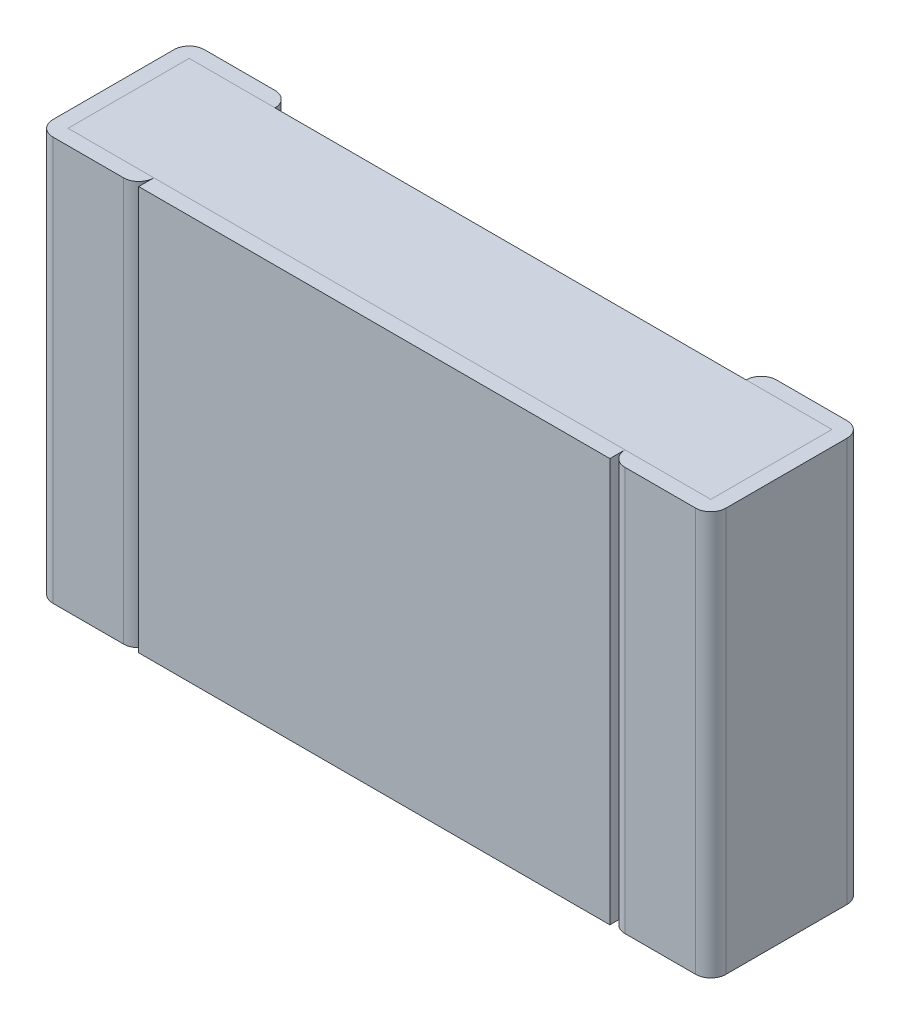
ISO-10303-21;
HEADER;
FILE_DESCRIPTION(('STEP AP214'),'2;1');
FILE_NAME('part.step','',(''),(''),'','','');
FILE_SCHEMA(('AUTOMOTIVE_DESIGN { 1 0 10303 214 1 1 1 1 }'));
ENDSEC;
DATA;
#1=APPLICATION_CONTEXT('core data for automotive mechanical design processes');
#2=APPLICATION_PROTOCOL_DEFINITION('international standard','automotive_design',2000,#1);
#3=PRODUCT_CONTEXT('',#1,'mechanical');
#4=PRODUCT('Part','Part','',(#3));
#5=PRODUCT_RELATED_PRODUCT_CATEGORY('part','',(#4));
#6=PRODUCT_DEFINITION_FORMATION('','',#4);
#7=PRODUCT_DEFINITION_CONTEXT('part definition',#1,'design');
#8=PRODUCT_DEFINITION('design','',#6,#7);
#9=PRODUCT_DEFINITION_SHAPE('','',#8);
#10=(LENGTH_UNIT() NAMED_UNIT(*) SI_UNIT(.MILLI.,.METRE.));
#11=(NAMED_UNIT(*) PLANE_ANGLE_UNIT() SI_UNIT($,.RADIAN.));
#12=(NAMED_UNIT(*) SI_UNIT($,.STERADIAN.) SOLID_ANGLE_UNIT());
#13=UNCERTAINTY_MEASURE_WITH_UNIT(LENGTH_MEASURE(1.E-05),#10,'distance_accuracy_value','');
#14=(GEOMETRIC_REPRESENTATION_CONTEXT(3) GLOBAL_UNCERTAINTY_ASSIGNED_CONTEXT((#13)) GLOBAL_UNIT_ASSIGNED_CONTEXT((#10,
#11,#12)) REPRESENTATION_CONTEXT('',''));
#15=CARTESIAN_POINT('',(0.,0.,0.));
#16=DIRECTION('',(0.,0.,1.));
#17=DIRECTION('',(1.,0.,0.));
#18=AXIS2_PLACEMENT_3D('',#15,#16,#17);
#19=CARTESIAN_POINT('',(-1.,-0.6,0.));
#20=DIRECTION('',(1.,0.,0.));
#21=DIRECTION('',(0.,1.,0.));
#22=AXIS2_PLACEMENT_3D('',#19,#20,#21);
#23=PLANE('',#22);
#24=DIRECTION('',(0.,1.,0.));
#25=VECTOR('',#24,1.);
#26=CARTESIAN_POINT('',(-1.,-0.6,0.405));
#27=LINE('',#26,#25);
#28=CARTESIAN_POINT('',(-1.,-0.6,0.405));
#29=VERTEX_POINT('',#28);
#30=CARTESIAN_POINT('',(-1.,0.6,0.405));
#31=VERTEX_POINT('',#30);
#32=EDGE_CURVE('E11',#29,#31,#27,.T.);
#33=ORIENTED_EDGE('',*,*,#32,.T.);
#34=DIRECTION('',(0.,0.,1.));
#35=VECTOR('',#34,1.);
#36=CARTESIAN_POINT('',(-1.,0.6,0.));
#37=LINE('',#36,#35);
#38=CARTESIAN_POINT('',(-1.,0.6,0.045));
#39=VERTEX_POINT('',#38);
#40=EDGE_CURVE('E40',#39,#31,#37,.T.);
#41=ORIENTED_EDGE('',*,*,#40,.F.);
#42=DIRECTION('',(0.,1.,0.));
#43=VECTOR('',#42,1.);
#44=CARTESIAN_POINT('',(-1.,-0.6,0.045));
#45=LINE('',#44,#43);
#46=CARTESIAN_POINT('',(-1.,-0.6,0.045));
#47=VERTEX_POINT('',#46);
#48=EDGE_CURVE('E309',#47,#39,#45,.T.);
#49=ORIENTED_EDGE('',*,*,#48,.F.);
#50=DIRECTION('',(0.,0.,1.));
#51=VECTOR('',#50,1.);
#52=CARTESIAN_POINT('',(-1.,-0.6,0.));
#53=LINE('',#52,#51);
#54=EDGE_CURVE('E26',#47,#29,#53,.T.);
#55=ORIENTED_EDGE('',*,*,#54,.T.);
#56=EDGE_LOOP('',(#33,#41,#49,#55));
#57=FACE_BOUND('',#56,.T.);
#58=ADVANCED_FACE('F16',(#57),#23,.F.);
#59=CARTESIAN_POINT('',(-1.,-0.6,0.));
#60=DIRECTION('',(0.,1.,0.));
#61=DIRECTION('',(1.,0.,0.));
#62=AXIS2_PLACEMENT_3D('',#59,#60,#61);
#63=PLANE('',#62);
#64=CARTESIAN_POINT('',(-0.745,-0.6,0.045));
#65=DIRECTION('',(0.,1.,0.));
#66=DIRECTION('',(0.,0.,1.));
#67=AXIS2_PLACEMENT_3D('',#64,#65,#66);
#68=CIRCLE('',#67,0.045);
#69=CARTESIAN_POINT('',(-0.7,-0.6,0.045));
#70=VERTEX_POINT('',#69);
#71=CARTESIAN_POINT('',(-0.745,-0.6,0.));
#72=VERTEX_POINT('',#71);
#73=EDGE_CURVE('E215',#70,#72,#68,.T.);
#74=ORIENTED_EDGE('',*,*,#73,.F.);
#75=DIRECTION('',(1.,0.,0.));
#76=VECTOR('',#75,1.);
#77=CARTESIAN_POINT('',(-0.955,-0.6,0.045));
#78=LINE('',#77,#76);
#79=CARTESIAN_POINT('',(-0.955,-0.6,0.045));
#80=VERTEX_POINT('',#79);
#81=EDGE_CURVE('E230',#80,#70,#78,.T.);
#82=ORIENTED_EDGE('',*,*,#81,.F.);
#83=DIRECTION('',(0.,0.,1.));
#84=VECTOR('',#83,1.);
#85=CARTESIAN_POINT('',(-0.955,-0.6,0.045));
#86=LINE('',#85,#84);
#87=CARTESIAN_POINT('',(-0.955,-0.6,0.405));
#88=VERTEX_POINT('',#87);
#89=EDGE_CURVE('E235',#80,#88,#86,.T.);
#90=ORIENTED_EDGE('',*,*,#89,.T.);
#91=DIRECTION('',(1.,0.,0.));
#92=VECTOR('',#91,1.);
#93=CARTESIAN_POINT('',(-0.955,-0.6,0.405));
#94=LINE('',#93,#92);
#95=CARTESIAN_POINT('',(-0.7,-0.6,0.405));
#96=VERTEX_POINT('',#95);
#97=EDGE_CURVE('E323',#88,#96,#94,.T.);
#98=ORIENTED_EDGE('',*,*,#97,.T.);
#99=CARTESIAN_POINT('',(-0.745,-0.6,0.405));
#100=DIRECTION('',(0.,-1.,0.));
#101=DIRECTION('',(0.,0.,1.));
#102=AXIS2_PLACEMENT_3D('',#99,#100,#101);
#103=CIRCLE('',#102,0.045);
#104=CARTESIAN_POINT('',(-0.745,-0.6,0.45));
#105=VERTEX_POINT('',#104);
#106=EDGE_CURVE('E327',#96,#105,#103,.T.);
#107=ORIENTED_EDGE('',*,*,#106,.T.);
#108=DIRECTION('',(1.,0.,0.));
#109=VECTOR('',#108,1.);
#110=CARTESIAN_POINT('',(-1.,-0.6,0.45));
#111=LINE('',#110,#109);
#112=CARTESIAN_POINT('',(-0.955,-0.6,0.45));
#113=VERTEX_POINT('',#112);
#114=EDGE_CURVE('E239',#113,#105,#111,.T.);
#115=ORIENTED_EDGE('',*,*,#114,.F.);
#116=CARTESIAN_POINT('',(-0.955,-0.6,0.405));
#117=DIRECTION('',(0.,1.,0.));
#118=DIRECTION('',(0.,0.,1.));
#119=AXIS2_PLACEMENT_3D('',#116,#117,#118);
#120=CIRCLE('',#119,0.045);
#121=EDGE_CURVE('E273',#29,#113,#120,.T.);
#122=ORIENTED_EDGE('',*,*,#121,.F.);
#123=ORIENTED_EDGE('',*,*,#54,.F.);
#124=CARTESIAN_POINT('',(-0.955,-0.6,0.045));
#125=DIRECTION('',(0.,-1.,0.));
#126=DIRECTION('',(0.,0.,1.));
#127=AXIS2_PLACEMENT_3D('',#124,#125,#126);
#128=CIRCLE('',#127,0.045);
#129=CARTESIAN_POINT('',(-0.955,-0.6,0.));
#130=VERTEX_POINT('',#129);
#131=EDGE_CURVE('E308',#47,#130,#128,.T.);
#132=ORIENTED_EDGE('',*,*,#131,.T.);
#133=DIRECTION('',(1.,0.,0.));
#134=VECTOR('',#133,1.);
#135=CARTESIAN_POINT('',(-1.,-0.6,0.));
#136=LINE('',#135,#134);
#137=EDGE_CURVE('E243',#130,#72,#136,.T.);
#138=ORIENTED_EDGE('',*,*,#137,.T.);
#139=EDGE_LOOP('',(#74,#82,#90,#98,#107,#115,#122,#123,#132,#138));
#140=FACE_BOUND('',#139,.T.);
#141=ADVANCED_FACE('F241',(#140),#63,.F.);
#142=CARTESIAN_POINT('',(-0.955,-0.6,0.045));
#143=DIRECTION('',(0.,1.,0.));
#144=DIRECTION('',(-1.,0.,0.));
#145=AXIS2_PLACEMENT_3D('',#142,#143,#144);
#146=CYLINDRICAL_SURFACE('',#145,0.045);
#147=ORIENTED_EDGE('',*,*,#48,.T.);
#148=CARTESIAN_POINT('',(-0.955,0.6,0.045));
#149=DIRECTION('',(0.,-1.,0.));
#150=DIRECTION('',(0.,0.,1.));
#151=AXIS2_PLACEMENT_3D('',#148,#149,#150);
#152=CIRCLE('',#151,0.045);
#153=CARTESIAN_POINT('',(-0.955,0.6,0.));
#154=VERTEX_POINT('',#153);
#155=EDGE_CURVE('E277',#39,#154,#152,.T.);
#156=ORIENTED_EDGE('',*,*,#155,.T.);
#157=DIRECTION('',(0.,1.,0.));
#158=VECTOR('',#157,1.);
#159=CARTESIAN_POINT('',(-0.955,-0.6,0.));
#160=LINE('',#159,#158);
#161=EDGE_CURVE('E305',#130,#154,#160,.T.);
#162=ORIENTED_EDGE('',*,*,#161,.F.);
#163=ORIENTED_EDGE('',*,*,#131,.F.);
#164=EDGE_LOOP('',(#147,#156,#162,#163));
#165=FACE_BOUND('',#164,.T.);
#166=ADVANCED_FACE('F562',(#165),#146,.T.);
#167=CARTESIAN_POINT('',(-0.955,-0.6,0.405));
#168=DIRECTION('',(0.,1.,0.));
#169=DIRECTION('',(-1.,0.,0.));
#170=AXIS2_PLACEMENT_3D('',#167,#168,#169);
#171=CYLINDRICAL_SURFACE('',#170,0.045);
#172=ORIENTED_EDGE('',*,*,#121,.T.);
#173=DIRECTION('',(0.,1.,0.));
#174=VECTOR('',#173,1.);
#175=CARTESIAN_POINT('',(-0.955,-0.6,0.45));
#176=LINE('',#175,#174);
#177=CARTESIAN_POINT('',(-0.955,0.6,0.45));
#178=VERTEX_POINT('',#177);
#179=EDGE_CURVE('E278',#113,#178,#176,.T.);
#180=ORIENTED_EDGE('',*,*,#179,.T.);
#181=CARTESIAN_POINT('',(-0.955,0.6,0.405));
#182=DIRECTION('',(0.,1.,0.));
#183=DIRECTION('',(0.,0.,1.));
#184=AXIS2_PLACEMENT_3D('',#181,#182,#183);
#185=CIRCLE('',#184,0.045);
#186=EDGE_CURVE('E287',#31,#178,#185,.T.);
#187=ORIENTED_EDGE('',*,*,#186,.F.);
#188=ORIENTED_EDGE('',*,*,#32,.F.);
#189=EDGE_LOOP('',(#172,#180,#187,#188));
#190=FACE_BOUND('',#189,.T.);
#191=ADVANCED_FACE('F568',(#190),#171,.T.);
#192=CARTESIAN_POINT('',(-1.,0.6,0.));
#193=DIRECTION('',(0.,1.,0.));
#194=DIRECTION('',(1.,0.,0.));
#195=AXIS2_PLACEMENT_3D('',#192,#193,#194);
#196=PLANE('',#195);
#197=DIRECTION('',(1.,0.,0.));
#198=VECTOR('',#197,1.);
#199=CARTESIAN_POINT('',(-1.,0.6,0.));
#200=LINE('',#199,#198);
#201=CARTESIAN_POINT('',(-0.745,0.6,0.));
#202=VERTEX_POINT('',#201);
#203=EDGE_CURVE('E246',#154,#202,#200,.T.);
#204=ORIENTED_EDGE('',*,*,#203,.F.);
#205=ORIENTED_EDGE('',*,*,#155,.F.);
#206=ORIENTED_EDGE('',*,*,#40,.T.);
#207=ORIENTED_EDGE('',*,*,#186,.T.);
#208=DIRECTION('',(1.,0.,0.));
#209=VECTOR('',#208,1.);
#210=CARTESIAN_POINT('',(-1.,0.6,0.45));
#211=LINE('',#210,#209);
#212=CARTESIAN_POINT('',(-0.745,0.6,0.45));
#213=VERTEX_POINT('',#212);
#214=EDGE_CURVE('E290',#178,#213,#211,.T.);
#215=ORIENTED_EDGE('',*,*,#214,.T.);
#216=CARTESIAN_POINT('',(-0.745,0.6,0.405));
#217=DIRECTION('',(0.,-1.,0.));
#218=DIRECTION('',(0.,0.,1.));
#219=AXIS2_PLACEMENT_3D('',#216,#217,#218);
#220=CIRCLE('',#219,0.045);
#221=CARTESIAN_POINT('',(-0.7,0.6,0.405));
#222=VERTEX_POINT('',#221);
#223=EDGE_CURVE('E369',#222,#213,#220,.T.);
#224=ORIENTED_EDGE('',*,*,#223,.F.);
#225=DIRECTION('',(1.,0.,0.));
#226=VECTOR('',#225,1.);
#227=CARTESIAN_POINT('',(-0.955,0.6,0.405));
#228=LINE('',#227,#226);
#229=CARTESIAN_POINT('',(-0.955,0.6,0.405));
#230=VERTEX_POINT('',#229);
#231=EDGE_CURVE('E378',#230,#222,#228,.T.);
#232=ORIENTED_EDGE('',*,*,#231,.F.);
#233=DIRECTION('',(0.,0.,1.));
#234=VECTOR('',#233,1.);
#235=CARTESIAN_POINT('',(-0.955,0.6,0.045));
#236=LINE('',#235,#234);
#237=CARTESIAN_POINT('',(-0.955,0.6,0.045));
#238=VERTEX_POINT('',#237);
#239=EDGE_CURVE('E373',#238,#230,#236,.T.);
#240=ORIENTED_EDGE('',*,*,#239,.F.);
#241=DIRECTION('',(1.,0.,0.));
#242=VECTOR('',#241,1.);
#243=CARTESIAN_POINT('',(-0.955,0.6,0.045));
#244=LINE('',#243,#242);
#245=CARTESIAN_POINT('',(-0.7,0.6,0.045));
#246=VERTEX_POINT('',#245);
#247=EDGE_CURVE('E298',#238,#246,#244,.T.);
#248=ORIENTED_EDGE('',*,*,#247,.T.);
#249=CARTESIAN_POINT('',(-0.745,0.6,0.045));
#250=DIRECTION('',(0.,1.,0.));
#251=DIRECTION('',(0.,0.,1.));
#252=AXIS2_PLACEMENT_3D('',#249,#250,#251);
#253=CIRCLE('',#252,0.045);
#254=EDGE_CURVE('E218',#246,#202,#253,.T.);
#255=ORIENTED_EDGE('',*,*,#254,.T.);
#256=EDGE_LOOP('',(#204,#205,#206,#207,#215,#224,#232,#240,#248,#255));
#257=FACE_BOUND('',#256,.T.);
#258=ADVANCED_FACE('F533',(#257),#196,.T.);
#259=CARTESIAN_POINT('',(-1.,-0.6,0.));
#260=DIRECTION('',(0.,0.,1.));
#261=DIRECTION('',(1.,0.,0.));
#262=AXIS2_PLACEMENT_3D('',#259,#260,#261);
#263=PLANE('',#262);
#264=DIRECTION('',(0.,1.,0.));
#265=VECTOR('',#264,1.);
#266=CARTESIAN_POINT('',(-0.745,-0.6,0.));
#267=LINE('',#266,#265);
#268=EDGE_CURVE('E247',#72,#202,#267,.T.);
#269=ORIENTED_EDGE('',*,*,#268,.F.);
#270=ORIENTED_EDGE('',*,*,#137,.F.);
#271=ORIENTED_EDGE('',*,*,#161,.T.);
#272=ORIENTED_EDGE('',*,*,#203,.T.);
#273=EDGE_LOOP('',(#269,#270,#271,#272));
#274=FACE_BOUND('',#273,.T.);
#275=ADVANCED_FACE('F559',(#274),#263,.F.);
#276=CARTESIAN_POINT('',(-0.745,-0.6,0.045));
#277=DIRECTION('',(0.,1.,0.));
#278=DIRECTION('',(1.,0.,0.));
#279=AXIS2_PLACEMENT_3D('',#276,#277,#278);
#280=CYLINDRICAL_SURFACE('',#279,0.045);
#281=ORIENTED_EDGE('',*,*,#73,.T.);
#282=ORIENTED_EDGE('',*,*,#268,.T.);
#283=ORIENTED_EDGE('',*,*,#254,.F.);
#284=DIRECTION('',(0.,1.,0.));
#285=VECTOR('',#284,1.);
#286=CARTESIAN_POINT('',(-0.7,-0.6,0.045));
#287=LINE('',#286,#285);
#288=EDGE_CURVE('E210',#70,#246,#287,.T.);
#289=ORIENTED_EDGE('',*,*,#288,.F.);
#290=EDGE_LOOP('',(#281,#282,#283,#289));
#291=FACE_BOUND('',#290,.T.);
#292=ADVANCED_FACE('F212',(#291),#280,.T.);
#293=CARTESIAN_POINT('',(-0.955,-0.6,0.045));
#294=DIRECTION('',(0.,1.,0.));
#295=DIRECTION('',(1.,0.,0.));
#296=AXIS2_PLACEMENT_3D('',#293,#294,#295);
#297=PLANE('',#296);
#298=DIRECTION('',(1.,0.,0.));
#299=VECTOR('',#298,1.);
#300=CARTESIAN_POINT('',(-0.955,-0.6,0.045));
#301=LINE('',#300,#299);
#302=CARTESIAN_POINT('',(0.7,-0.6,0.045));
#303=VERTEX_POINT('',#302);
#304=EDGE_CURVE('E232',#70,#303,#301,.T.);
#305=ORIENTED_EDGE('',*,*,#304,.T.);
#306=DIRECTION('',(1.,0.,0.));
#307=VECTOR('',#306,1.);
#308=CARTESIAN_POINT('',(-0.955,-0.6,0.045));
#309=LINE('',#308,#307);
#310=CARTESIAN_POINT('',(0.955,-0.6,0.045));
#311=VERTEX_POINT('',#310);
#312=EDGE_CURVE('E253',#303,#311,#309,.T.);
#313=ORIENTED_EDGE('',*,*,#312,.T.);
#314=DIRECTION('',(0.,0.,1.));
#315=VECTOR('',#314,1.);
#316=CARTESIAN_POINT('',(0.955,-0.6,0.045));
#317=LINE('',#316,#315);
#318=CARTESIAN_POINT('',(0.955,-0.6,0.405));
#319=VERTEX_POINT('',#318);
#320=EDGE_CURVE('E238',#311,#319,#317,.T.);
#321=ORIENTED_EDGE('',*,*,#320,.T.);
#322=DIRECTION('',(1.,0.,0.));
#323=VECTOR('',#322,1.);
#324=CARTESIAN_POINT('',(-0.955,-0.6,0.405));
#325=LINE('',#324,#323);
#326=CARTESIAN_POINT('',(0.7,-0.6,0.405));
#327=VERTEX_POINT('',#326);
#328=EDGE_CURVE('E359',#327,#319,#325,.T.);
#329=ORIENTED_EDGE('',*,*,#328,.F.);
#330=DIRECTION('',(1.,0.,0.));
#331=VECTOR('',#330,1.);
#332=CARTESIAN_POINT('',(-0.7,-0.6,0.405));
#333=LINE('',#332,#331);
#334=EDGE_CURVE('E272',#96,#327,#333,.T.);
#335=ORIENTED_EDGE('',*,*,#334,.F.);
#336=ORIENTED_EDGE('',*,*,#97,.F.);
#337=ORIENTED_EDGE('',*,*,#89,.F.);
#338=ORIENTED_EDGE('',*,*,#81,.T.);
#339=EDGE_LOOP('',(#305,#313,#321,#329,#335,#336,#337,#338));
#340=FACE_BOUND('',#339,.T.);
#341=ADVANCED_FACE('F231',(#340),#297,.F.);
#342=CARTESIAN_POINT('',(-1.,-0.6,0.45));
#343=DIRECTION('',(0.,0.,1.));
#344=DIRECTION('',(1.,0.,0.));
#345=AXIS2_PLACEMENT_3D('',#342,#343,#344);
#346=PLANE('',#345);
#347=ORIENTED_EDGE('',*,*,#214,.F.);
#348=ORIENTED_EDGE('',*,*,#179,.F.);
#349=ORIENTED_EDGE('',*,*,#114,.T.);
#350=DIRECTION('',(0.,1.,0.));
#351=VECTOR('',#350,1.);
#352=CARTESIAN_POINT('',(-0.745,-0.6,0.45));
#353=LINE('',#352,#351);
#354=EDGE_CURVE('E19',#105,#213,#353,.T.);
#355=ORIENTED_EDGE('',*,*,#354,.T.);
#356=EDGE_LOOP('',(#347,#348,#349,#355));
#357=FACE_BOUND('',#356,.T.);
#358=ADVANCED_FACE('F547',(#357),#346,.T.);
#359=CARTESIAN_POINT('',(-0.745,-0.6,0.405));
#360=DIRECTION('',(0.,1.,0.));
#361=DIRECTION('',(1.,0.,0.));
#362=AXIS2_PLACEMENT_3D('',#359,#360,#361);
#363=CYLINDRICAL_SURFACE('',#362,0.045);
#364=DIRECTION('',(0.,1.,0.));
#365=VECTOR('',#364,1.);
#366=CARTESIAN_POINT('',(-0.7,-0.6,0.405));
#367=LINE('',#366,#365);
#368=EDGE_CURVE('E372',#96,#222,#367,.T.);
#369=ORIENTED_EDGE('',*,*,#368,.T.);
#370=ORIENTED_EDGE('',*,*,#223,.T.);
#371=ORIENTED_EDGE('',*,*,#354,.F.);
#372=ORIENTED_EDGE('',*,*,#106,.F.);
#373=EDGE_LOOP('',(#369,#370,#371,#372));
#374=FACE_BOUND('',#373,.T.);
#375=ADVANCED_FACE('F541',(#374),#363,.T.);
#376=CARTESIAN_POINT('',(-0.955,0.6,0.045));
#377=DIRECTION('',(0.,1.,0.));
#378=DIRECTION('',(1.,0.,0.));
#379=AXIS2_PLACEMENT_3D('',#376,#377,#378);
#380=PLANE('',#379);
#381=ORIENTED_EDGE('',*,*,#247,.F.);
#382=ORIENTED_EDGE('',*,*,#239,.T.);
#383=ORIENTED_EDGE('',*,*,#231,.T.);
#384=DIRECTION('',(1.,0.,0.));
#385=VECTOR('',#384,1.);
#386=CARTESIAN_POINT('',(-0.7,0.6,0.405));
#387=LINE('',#386,#385);
#388=CARTESIAN_POINT('',(0.7,0.6,0.405));
#389=VERTEX_POINT('',#388);
#390=EDGE_CURVE('E374',#222,#389,#387,.T.);
#391=ORIENTED_EDGE('',*,*,#390,.T.);
#392=DIRECTION('',(1.,0.,0.));
#393=VECTOR('',#392,1.);
#394=CARTESIAN_POINT('',(-0.955,0.6,0.405));
#395=LINE('',#394,#393);
#396=CARTESIAN_POINT('',(0.955,0.6,0.405));
#397=VERTEX_POINT('',#396);
#398=EDGE_CURVE('E379',#389,#397,#395,.T.);
#399=ORIENTED_EDGE('',*,*,#398,.T.);
#400=DIRECTION('',(0.,0.,1.));
#401=VECTOR('',#400,1.);
#402=CARTESIAN_POINT('',(0.955,0.6,0.045));
#403=LINE('',#402,#401);
#404=CARTESIAN_POINT('',(0.955,0.6,0.045));
#405=VERTEX_POINT('',#404);
#406=EDGE_CURVE('E331',#405,#397,#403,.T.);
#407=ORIENTED_EDGE('',*,*,#406,.F.);
#408=DIRECTION('',(1.,0.,0.));
#409=VECTOR('',#408,1.);
#410=CARTESIAN_POINT('',(-0.955,0.6,0.045));
#411=LINE('',#410,#409);
#412=CARTESIAN_POINT('',(0.7,0.6,0.045));
#413=VERTEX_POINT('',#412);
#414=EDGE_CURVE('E317',#413,#405,#411,.T.);
#415=ORIENTED_EDGE('',*,*,#414,.F.);
#416=DIRECTION('',(1.,0.,0.));
#417=VECTOR('',#416,1.);
#418=CARTESIAN_POINT('',(-0.955,0.6,0.045));
#419=LINE('',#418,#417);
#420=EDGE_CURVE('E224',#246,#413,#419,.T.);
#421=ORIENTED_EDGE('',*,*,#420,.F.);
#422=EDGE_LOOP('',(#381,#382,#383,#391,#399,#407,#415,#421));
#423=FACE_BOUND('',#422,.T.);
#424=ADVANCED_FACE('F531',(#423),#380,.T.);
#425=CARTESIAN_POINT('',(-0.955,-0.6,0.045));
#426=DIRECTION('',(0.,0.,1.));
#427=DIRECTION('',(1.,0.,0.));
#428=AXIS2_PLACEMENT_3D('',#425,#426,#427);
#429=PLANE('',#428);
#430=ORIENTED_EDGE('',*,*,#420,.T.);
#431=DIRECTION('',(0.,1.,0.));
#432=VECTOR('',#431,1.);
#433=CARTESIAN_POINT('',(0.7,-0.6,0.045));
#434=LINE('',#433,#432);
#435=EDGE_CURVE('E250',#303,#413,#434,.T.);
#436=ORIENTED_EDGE('',*,*,#435,.F.);
#437=ORIENTED_EDGE('',*,*,#304,.F.);
#438=ORIENTED_EDGE('',*,*,#288,.T.);
#439=EDGE_LOOP('',(#430,#436,#437,#438));
#440=FACE_BOUND('',#439,.T.);
#441=ADVANCED_FACE('F249',(#440),#429,.F.);
#442=CARTESIAN_POINT('',(0.7,-0.6,0.));
#443=DIRECTION('',(0.,1.,0.));
#444=DIRECTION('',(1.,0.,0.));
#445=AXIS2_PLACEMENT_3D('',#442,#443,#444);
#446=PLANE('',#445);
#447=CARTESIAN_POINT('',(0.955,-0.6,0.045));
#448=DIRECTION('',(0.,1.,0.));
#449=DIRECTION('',(0.,0.,1.));
#450=AXIS2_PLACEMENT_3D('',#447,#448,#449);
#451=CIRCLE('',#450,0.045);
#452=CARTESIAN_POINT('',(1.,-0.6,0.045));
#453=VERTEX_POINT('',#452);
#454=CARTESIAN_POINT('',(0.955,-0.6,0.));
#455=VERTEX_POINT('',#454);
#456=EDGE_CURVE('E111',#453,#455,#451,.T.);
#457=ORIENTED_EDGE('',*,*,#456,.F.);
#458=DIRECTION('',(0.,0.,1.));
#459=VECTOR('',#458,1.);
#460=CARTESIAN_POINT('',(1.,-0.6,0.));
#461=LINE('',#460,#459);
#462=CARTESIAN_POINT('',(1.,-0.6,0.405));
#463=VERTEX_POINT('',#462);
#464=EDGE_CURVE('E225',#453,#463,#461,.T.);
#465=ORIENTED_EDGE('',*,*,#464,.T.);
#466=CARTESIAN_POINT('',(0.955,-0.6,0.405));
#467=DIRECTION('',(0.,-1.,0.));
#468=DIRECTION('',(0.,0.,1.));
#469=AXIS2_PLACEMENT_3D('',#466,#467,#468);
#470=CIRCLE('',#469,0.045);
#471=CARTESIAN_POINT('',(0.955,-0.6,0.45));
#472=VERTEX_POINT('',#471);
#473=EDGE_CURVE('E335',#463,#472,#470,.T.);
#474=ORIENTED_EDGE('',*,*,#473,.T.);
#475=DIRECTION('',(1.,0.,0.));
#476=VECTOR('',#475,1.);
#477=CARTESIAN_POINT('',(0.7,-0.6,0.45));
#478=LINE('',#477,#476);
#479=CARTESIAN_POINT('',(0.745,-0.6,0.45));
#480=VERTEX_POINT('',#479);
#481=EDGE_CURVE('E363',#480,#472,#478,.T.);
#482=ORIENTED_EDGE('',*,*,#481,.F.);
#483=CARTESIAN_POINT('',(0.745,-0.6,0.405));
#484=DIRECTION('',(0.,1.,0.));
#485=DIRECTION('',(0.,0.,1.));
#486=AXIS2_PLACEMENT_3D('',#483,#484,#485);
#487=CIRCLE('',#486,0.045);
#488=EDGE_CURVE('E406',#327,#480,#487,.T.);
#489=ORIENTED_EDGE('',*,*,#488,.F.);
#490=ORIENTED_EDGE('',*,*,#328,.T.);
#491=ORIENTED_EDGE('',*,*,#320,.F.);
#492=ORIENTED_EDGE('',*,*,#312,.F.);
#493=CARTESIAN_POINT('',(0.745,-0.6,0.045));
#494=DIRECTION('',(0.,-1.,0.));
#495=DIRECTION('',(0.,0.,1.));
#496=AXIS2_PLACEMENT_3D('',#493,#494,#495);
#497=CIRCLE('',#496,0.045);
#498=CARTESIAN_POINT('',(0.745,-0.6,0.));
#499=VERTEX_POINT('',#498);
#500=EDGE_CURVE('E267',#303,#499,#497,.T.);
#501=ORIENTED_EDGE('',*,*,#500,.T.);
#502=DIRECTION('',(1.,0.,0.));
#503=VECTOR('',#502,1.);
#504=CARTESIAN_POINT('',(0.7,-0.6,0.));
#505=LINE('',#504,#503);
#506=EDGE_CURVE('E95',#499,#455,#505,.T.);
#507=ORIENTED_EDGE('',*,*,#506,.T.);
#508=EDGE_LOOP('',(#457,#465,#474,#482,#489,#490,#491,#492,#501,#507));
#509=FACE_BOUND('',#508,.T.);
#510=ADVANCED_FACE('F518',(#509),#446,.F.);
#511=CARTESIAN_POINT('',(-0.7,-0.6,0.405));
#512=DIRECTION('',(0.,1.,0.));
#513=DIRECTION('',(1.,0.,0.));
#514=AXIS2_PLACEMENT_3D('',#511,#512,#513);
#515=PLANE('',#514);
#516=DIRECTION('',(0.,0.,1.));
#517=VECTOR('',#516,1.);
#518=CARTESIAN_POINT('',(0.7,-0.6,0.405));
#519=LINE('',#518,#517);
#520=CARTESIAN_POINT('',(0.7,-0.6,0.45));
#521=VERTEX_POINT('',#520);
#522=EDGE_CURVE('E268',#327,#521,#519,.T.);
#523=ORIENTED_EDGE('',*,*,#522,.T.);
#524=DIRECTION('',(1.,0.,0.));
#525=VECTOR('',#524,1.);
#526=CARTESIAN_POINT('',(-0.7,-0.6,0.45));
#527=LINE('',#526,#525);
#528=CARTESIAN_POINT('',(-0.7,-0.6,0.45));
#529=VERTEX_POINT('',#528);
#530=EDGE_CURVE('E322',#529,#521,#527,.T.);
#531=ORIENTED_EDGE('',*,*,#530,.F.);
#532=DIRECTION('',(0.,0.,1.));
#533=VECTOR('',#532,1.);
#534=CARTESIAN_POINT('',(-0.7,-0.6,0.405));
#535=LINE('',#534,#533);
#536=EDGE_CURVE('E312',#96,#529,#535,.T.);
#537=ORIENTED_EDGE('',*,*,#536,.F.);
#538=ORIENTED_EDGE('',*,*,#334,.T.);
#539=EDGE_LOOP('',(#523,#531,#537,#538));
#540=FACE_BOUND('',#539,.T.);
#541=ADVANCED_FACE('F490',(#540),#515,.F.);
#542=CARTESIAN_POINT('',(-0.7,-0.6,0.405));
#543=DIRECTION('',(1.,0.,0.));
#544=DIRECTION('',(0.,1.,0.));
#545=AXIS2_PLACEMENT_3D('',#542,#543,#544);
#546=PLANE('',#545);
#547=DIRECTION('',(0.,1.,0.));
#548=VECTOR('',#547,1.);
#549=CARTESIAN_POINT('',(-0.7,-0.6,0.45));
#550=LINE('',#549,#548);
#551=CARTESIAN_POINT('',(-0.7,0.6,0.45));
#552=VERTEX_POINT('',#551);
#553=EDGE_CURVE('E316',#529,#552,#550,.T.);
#554=ORIENTED_EDGE('',*,*,#553,.T.);
#555=DIRECTION('',(0.,0.,1.));
#556=VECTOR('',#555,1.);
#557=CARTESIAN_POINT('',(-0.7,0.6,0.405));
#558=LINE('',#557,#556);
#559=EDGE_CURVE('E295',#222,#552,#558,.T.);
#560=ORIENTED_EDGE('',*,*,#559,.F.);
#561=ORIENTED_EDGE('',*,*,#368,.F.);
#562=ORIENTED_EDGE('',*,*,#536,.T.);
#563=EDGE_LOOP('',(#554,#560,#561,#562));
#564=FACE_BOUND('',#563,.T.);
#565=ADVANCED_FACE('F484',(#564),#546,.F.);
#566=CARTESIAN_POINT('',(0.7,0.6,0.));
#567=DIRECTION('',(0.,1.,0.));
#568=DIRECTION('',(1.,0.,0.));
#569=AXIS2_PLACEMENT_3D('',#566,#567,#568);
#570=PLANE('',#569);
#571=DIRECTION('',(1.,0.,0.));
#572=VECTOR('',#571,1.);
#573=CARTESIAN_POINT('',(0.7,0.6,0.));
#574=LINE('',#573,#572);
#575=CARTESIAN_POINT('',(0.745,0.6,0.));
#576=VERTEX_POINT('',#575);
#577=CARTESIAN_POINT('',(0.955,0.6,0.));
#578=VERTEX_POINT('',#577);
#579=EDGE_CURVE('E402',#576,#578,#574,.T.);
#580=ORIENTED_EDGE('',*,*,#579,.F.);
#581=CARTESIAN_POINT('',(0.745,0.6,0.045));
#582=DIRECTION('',(0.,-1.,0.));
#583=DIRECTION('',(0.,0.,1.));
#584=AXIS2_PLACEMENT_3D('',#581,#582,#583);
#585=CIRCLE('',#584,0.045);
#586=EDGE_CURVE('E279',#413,#576,#585,.T.);
#587=ORIENTED_EDGE('',*,*,#586,.F.);
#588=ORIENTED_EDGE('',*,*,#414,.T.);
#589=ORIENTED_EDGE('',*,*,#406,.T.);
#590=ORIENTED_EDGE('',*,*,#398,.F.);
#591=CARTESIAN_POINT('',(0.745,0.6,0.405));
#592=DIRECTION('',(0.,1.,0.));
#593=DIRECTION('',(0.,0.,1.));
#594=AXIS2_PLACEMENT_3D('',#591,#592,#593);
#595=CIRCLE('',#594,0.045);
#596=CARTESIAN_POINT('',(0.745,0.6,0.45));
#597=VERTEX_POINT('',#596);
#598=EDGE_CURVE('E349',#389,#597,#595,.T.);
#599=ORIENTED_EDGE('',*,*,#598,.T.);
#600=DIRECTION('',(1.,0.,0.));
#601=VECTOR('',#600,1.);
#602=CARTESIAN_POINT('',(0.7,0.6,0.45));
#603=LINE('',#602,#601);
#604=CARTESIAN_POINT('',(0.955,0.6,0.45));
#605=VERTEX_POINT('',#604);
#606=EDGE_CURVE('E345',#597,#605,#603,.T.);
#607=ORIENTED_EDGE('',*,*,#606,.T.);
#608=CARTESIAN_POINT('',(0.955,0.6,0.405));
#609=DIRECTION('',(0.,-1.,0.));
#610=DIRECTION('',(0.,0.,1.));
#611=AXIS2_PLACEMENT_3D('',#608,#609,#610);
#612=CIRCLE('',#611,0.045);
#613=CARTESIAN_POINT('',(1.,0.6,0.405));
#614=VERTEX_POINT('',#613);
#615=EDGE_CURVE('E360',#614,#605,#612,.T.);
#616=ORIENTED_EDGE('',*,*,#615,.F.);
#617=DIRECTION('',(0.,0.,1.));
#618=VECTOR('',#617,1.);
#619=CARTESIAN_POINT('',(1.,0.6,0.));
#620=LINE('',#619,#618);
#621=CARTESIAN_POINT('',(1.,0.6,0.045));
#622=VERTEX_POINT('',#621);
#623=EDGE_CURVE('E264',#622,#614,#620,.T.);
#624=ORIENTED_EDGE('',*,*,#623,.F.);
#625=CARTESIAN_POINT('',(0.955,0.6,0.045));
#626=DIRECTION('',(0.,1.,0.));
#627=DIRECTION('',(0.,0.,1.));
#628=AXIS2_PLACEMENT_3D('',#625,#626,#627);
#629=CIRCLE('',#628,0.045);
#630=EDGE_CURVE('E350',#622,#578,#629,.T.);
#631=ORIENTED_EDGE('',*,*,#630,.T.);
#632=EDGE_LOOP('',(#580,#587,#588,#589,#590,#599,#607,#616,#624,#631));
#633=FACE_BOUND('',#632,.T.);
#634=ADVANCED_FACE('F509',(#633),#570,.T.);
#635=CARTESIAN_POINT('',(-0.7,0.6,0.405));
#636=DIRECTION('',(0.,1.,0.));
#637=DIRECTION('',(1.,0.,0.));
#638=AXIS2_PLACEMENT_3D('',#635,#636,#637);
#639=PLANE('',#638);
#640=ORIENTED_EDGE('',*,*,#390,.F.);
#641=ORIENTED_EDGE('',*,*,#559,.T.);
#642=DIRECTION('',(1.,0.,0.));
#643=VECTOR('',#642,1.);
#644=CARTESIAN_POINT('',(-0.7,0.6,0.45));
#645=LINE('',#644,#643);
#646=CARTESIAN_POINT('',(0.7,0.6,0.45));
#647=VERTEX_POINT('',#646);
#648=EDGE_CURVE('E291',#552,#647,#645,.T.);
#649=ORIENTED_EDGE('',*,*,#648,.T.);
#650=DIRECTION('',(0.,0.,1.));
#651=VECTOR('',#650,1.);
#652=CARTESIAN_POINT('',(0.7,0.6,0.405));
#653=LINE('',#652,#651);
#654=EDGE_CURVE('E318',#389,#647,#653,.T.);
#655=ORIENTED_EDGE('',*,*,#654,.F.);
#656=EDGE_LOOP('',(#640,#641,#649,#655));
#657=FACE_BOUND('',#656,.T.);
#658=ADVANCED_FACE('F478',(#657),#639,.T.);
#659=CARTESIAN_POINT('',(0.745,-0.6,0.045));
#660=DIRECTION('',(0.,1.,0.));
#661=DIRECTION('',(-1.,0.,0.));
#662=AXIS2_PLACEMENT_3D('',#659,#660,#661);
#663=CYLINDRICAL_SURFACE('',#662,0.045);
#664=ORIENTED_EDGE('',*,*,#435,.T.);
#665=ORIENTED_EDGE('',*,*,#586,.T.);
#666=DIRECTION('',(0.,1.,0.));
#667=VECTOR('',#666,1.);
#668=CARTESIAN_POINT('',(0.745,-0.6,0.));
#669=LINE('',#668,#667);
#670=EDGE_CURVE('E283',#499,#576,#669,.T.);
#671=ORIENTED_EDGE('',*,*,#670,.F.);
#672=ORIENTED_EDGE('',*,*,#500,.F.);
#673=EDGE_LOOP('',(#664,#665,#671,#672));
#674=FACE_BOUND('',#673,.T.);
#675=ADVANCED_FACE('F527',(#674),#663,.T.);
#676=CARTESIAN_POINT('',(0.7,-0.6,0.));
#677=DIRECTION('',(0.,0.,1.));
#678=DIRECTION('',(1.,0.,0.));
#679=AXIS2_PLACEMENT_3D('',#676,#677,#678);
#680=PLANE('',#679);
#681=DIRECTION('',(0.,1.,0.));
#682=VECTOR('',#681,1.);
#683=CARTESIAN_POINT('',(0.955,-0.6,0.));
#684=LINE('',#683,#682);
#685=EDGE_CURVE('E365',#455,#578,#684,.T.);
#686=ORIENTED_EDGE('',*,*,#685,.F.);
#687=ORIENTED_EDGE('',*,*,#506,.F.);
#688=ORIENTED_EDGE('',*,*,#670,.T.);
#689=ORIENTED_EDGE('',*,*,#579,.T.);
#690=EDGE_LOOP('',(#686,#687,#688,#689));
#691=FACE_BOUND('',#690,.T.);
#692=ADVANCED_FACE('F523',(#691),#680,.F.);
#693=CARTESIAN_POINT('',(0.955,-0.6,0.045));
#694=DIRECTION('',(0.,1.,0.));
#695=DIRECTION('',(1.,0.,0.));
#696=AXIS2_PLACEMENT_3D('',#693,#694,#695);
#697=CYLINDRICAL_SURFACE('',#696,0.045);
#698=ORIENTED_EDGE('',*,*,#456,.T.);
#699=ORIENTED_EDGE('',*,*,#685,.T.);
#700=ORIENTED_EDGE('',*,*,#630,.F.);
#701=DIRECTION('',(0.,1.,0.));
#702=VECTOR('',#701,1.);
#703=CARTESIAN_POINT('',(1.,-0.6,0.045));
#704=LINE('',#703,#702);
#705=EDGE_CURVE('E367',#453,#622,#704,.T.);
#706=ORIENTED_EDGE('',*,*,#705,.F.);
#707=EDGE_LOOP('',(#698,#699,#700,#706));
#708=FACE_BOUND('',#707,.T.);
#709=ADVANCED_FACE('F519',(#708),#697,.T.);
#710=CARTESIAN_POINT('',(1.,-0.6,0.));
#711=DIRECTION('',(1.,0.,0.));
#712=DIRECTION('',(0.,1.,0.));
#713=AXIS2_PLACEMENT_3D('',#710,#711,#712);
#714=PLANE('',#713);
#715=ORIENTED_EDGE('',*,*,#464,.F.);
#716=ORIENTED_EDGE('',*,*,#705,.T.);
#717=ORIENTED_EDGE('',*,*,#623,.T.);
#718=DIRECTION('',(0.,1.,0.));
#719=VECTOR('',#718,1.);
#720=CARTESIAN_POINT('',(1.,-0.6,0.405));
#721=LINE('',#720,#719);
#722=EDGE_CURVE('E362',#463,#614,#721,.T.);
#723=ORIENTED_EDGE('',*,*,#722,.F.);
#724=EDGE_LOOP('',(#715,#716,#717,#723));
#725=FACE_BOUND('',#724,.T.);
#726=ADVANCED_FACE('F516',(#725),#714,.T.);
#727=CARTESIAN_POINT('',(0.955,-0.6,0.405));
#728=DIRECTION('',(0.,1.,0.));
#729=DIRECTION('',(1.,0.,0.));
#730=AXIS2_PLACEMENT_3D('',#727,#728,#729);
#731=CYLINDRICAL_SURFACE('',#730,0.045);
#732=ORIENTED_EDGE('',*,*,#722,.T.);
#733=ORIENTED_EDGE('',*,*,#615,.T.);
#734=DIRECTION('',(0.,1.,0.));
#735=VECTOR('',#734,1.);
#736=CARTESIAN_POINT('',(0.955,-0.6,0.45));
#737=LINE('',#736,#735);
#738=EDGE_CURVE('E409',#472,#605,#737,.T.);
#739=ORIENTED_EDGE('',*,*,#738,.F.);
#740=ORIENTED_EDGE('',*,*,#473,.F.);
#741=EDGE_LOOP('',(#732,#733,#739,#740));
#742=FACE_BOUND('',#741,.T.);
#743=ADVANCED_FACE('F517',(#742),#731,.T.);
#744=CARTESIAN_POINT('',(0.7,-0.6,0.45));
#745=DIRECTION('',(0.,0.,1.));
#746=DIRECTION('',(1.,0.,0.));
#747=AXIS2_PLACEMENT_3D('',#744,#745,#746);
#748=PLANE('',#747);
#749=ORIENTED_EDGE('',*,*,#606,.F.);
#750=DIRECTION('',(0.,1.,0.));
#751=VECTOR('',#750,1.);
#752=CARTESIAN_POINT('',(0.745,-0.6,0.45));
#753=LINE('',#752,#751);
#754=EDGE_CURVE('E410',#480,#597,#753,.T.);
#755=ORIENTED_EDGE('',*,*,#754,.F.);
#756=ORIENTED_EDGE('',*,*,#481,.T.);
#757=ORIENTED_EDGE('',*,*,#738,.T.);
#758=EDGE_LOOP('',(#749,#755,#756,#757));
#759=FACE_BOUND('',#758,.T.);
#760=ADVANCED_FACE('F508',(#759),#748,.T.);
#761=CARTESIAN_POINT('',(0.745,-0.6,0.405));
#762=DIRECTION('',(0.,1.,0.));
#763=DIRECTION('',(-1.,0.,0.));
#764=AXIS2_PLACEMENT_3D('',#761,#762,#763);
#765=CYLINDRICAL_SURFACE('',#764,0.045);
#766=ORIENTED_EDGE('',*,*,#488,.T.);
#767=ORIENTED_EDGE('',*,*,#754,.T.);
#768=ORIENTED_EDGE('',*,*,#598,.F.);
#769=DIRECTION('',(0.,1.,0.));
#770=VECTOR('',#769,1.);
#771=CARTESIAN_POINT('',(0.7,-0.6,0.405));
#772=LINE('',#771,#770);
#773=EDGE_CURVE('E321',#327,#389,#772,.T.);
#774=ORIENTED_EDGE('',*,*,#773,.F.);
#775=EDGE_LOOP('',(#766,#767,#768,#774));
#776=FACE_BOUND('',#775,.T.);
#777=ADVANCED_FACE('F507',(#776),#765,.T.);
#778=CARTESIAN_POINT('',(0.7,-0.6,0.405));
#779=DIRECTION('',(1.,0.,0.));
#780=DIRECTION('',(0.,1.,0.));
#781=AXIS2_PLACEMENT_3D('',#778,#779,#780);
#782=PLANE('',#781);
#783=ORIENTED_EDGE('',*,*,#522,.F.);
#784=ORIENTED_EDGE('',*,*,#773,.T.);
#785=ORIENTED_EDGE('',*,*,#654,.T.);
#786=DIRECTION('',(0.,1.,0.));
#787=VECTOR('',#786,1.);
#788=CARTESIAN_POINT('',(0.7,-0.6,0.45));
#789=LINE('',#788,#787);
#790=EDGE_CURVE('E338',#521,#647,#789,.T.);
#791=ORIENTED_EDGE('',*,*,#790,.F.);
#792=EDGE_LOOP('',(#783,#784,#785,#791));
#793=FACE_BOUND('',#792,.T.);
#794=ADVANCED_FACE('F474',(#793),#782,.T.);
#795=CARTESIAN_POINT('',(-0.7,-0.6,0.45));
#796=DIRECTION('',(0.,0.,1.));
#797=DIRECTION('',(1.,0.,0.));
#798=AXIS2_PLACEMENT_3D('',#795,#796,#797);
#799=PLANE('',#798);
#800=ORIENTED_EDGE('',*,*,#553,.F.);
#801=ORIENTED_EDGE('',*,*,#530,.T.);
#802=ORIENTED_EDGE('',*,*,#790,.T.);
#803=ORIENTED_EDGE('',*,*,#648,.F.);
#804=EDGE_LOOP('',(#800,#801,#802,#803));
#805=FACE_BOUND('',#804,.T.);
#806=ADVANCED_FACE('F471',(#805),#799,.T.);
#807=CLOSED_SHELL('',(#58,#141,#166,#191,#258,#275,#292,#341,#358,#375,#424,#441,#510,#541,#565,
#634,#658,#675,#692,#709,#726,#743,#760,#777,#794,#806));
#808=MANIFOLD_SOLID_BREP('B1',#807);
#809=ADVANCED_BREP_SHAPE_REPRESENTATION('',(#18,#808),#14);
#810=SHAPE_DEFINITION_REPRESENTATION(#9,#809);
ENDSEC;
END-ISO-10303-21;
